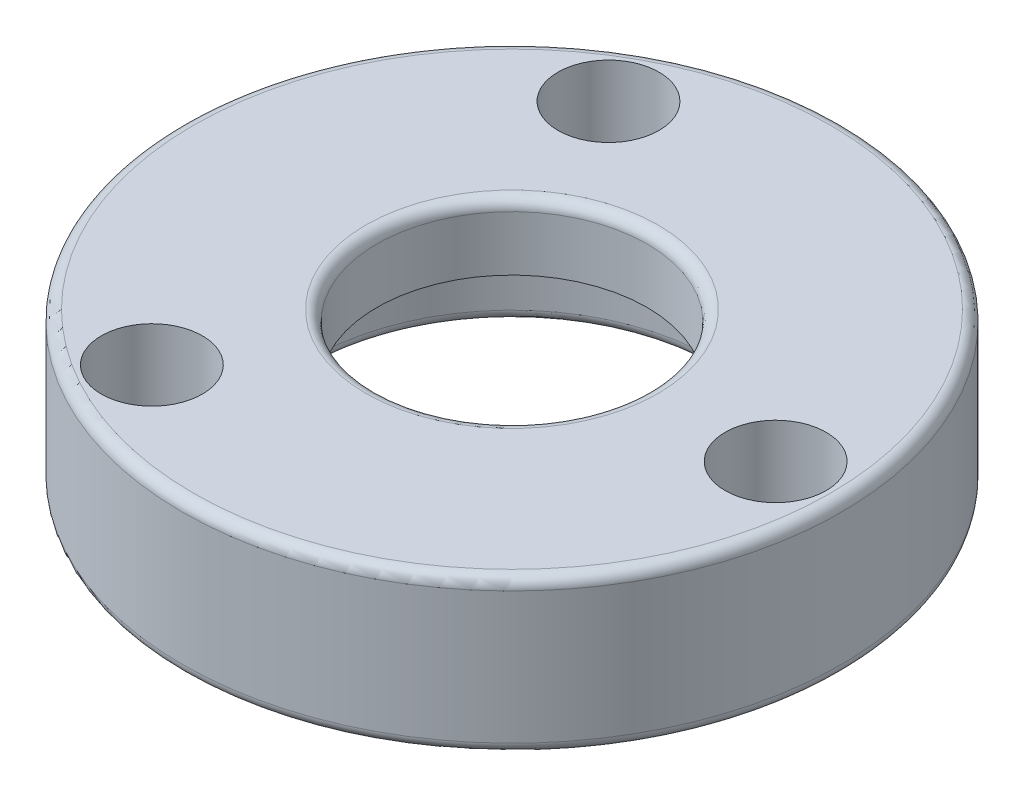
ISO-10303-21;
HEADER;
FILE_DESCRIPTION(('STEP AP214'),'2;1');
FILE_NAME('part.step','',(''),(''),'','','');
FILE_SCHEMA(('AUTOMOTIVE_DESIGN { 1 0 10303 214 1 1 1 1 }'));
ENDSEC;
DATA;
#1=APPLICATION_CONTEXT('core data for automotive mechanical design processes');
#2=APPLICATION_PROTOCOL_DEFINITION('international standard','automotive_design',2000,#1);
#3=PRODUCT_CONTEXT('',#1,'mechanical');
#4=PRODUCT('Part','Part','',(#3));
#5=PRODUCT_RELATED_PRODUCT_CATEGORY('part','',(#4));
#6=PRODUCT_DEFINITION_FORMATION('','',#4);
#7=PRODUCT_DEFINITION_CONTEXT('part definition',#1,'design');
#8=PRODUCT_DEFINITION('design','',#6,#7);
#9=PRODUCT_DEFINITION_SHAPE('','',#8);
#10=(LENGTH_UNIT() NAMED_UNIT(*) SI_UNIT(.MILLI.,.METRE.));
#11=(NAMED_UNIT(*) PLANE_ANGLE_UNIT() SI_UNIT($,.RADIAN.));
#12=(NAMED_UNIT(*) SI_UNIT($,.STERADIAN.) SOLID_ANGLE_UNIT());
#13=UNCERTAINTY_MEASURE_WITH_UNIT(LENGTH_MEASURE(1.E-05),#10,'distance_accuracy_value','');
#14=(GEOMETRIC_REPRESENTATION_CONTEXT(3) GLOBAL_UNCERTAINTY_ASSIGNED_CONTEXT((#13)) GLOBAL_UNIT_ASSIGNED_CONTEXT((#10,
#11,#12)) REPRESENTATION_CONTEXT('',''));
#15=CARTESIAN_POINT('',(0.,0.,0.));
#16=DIRECTION('',(0.,0.,1.));
#17=DIRECTION('',(1.,0.,0.));
#18=AXIS2_PLACEMENT_3D('',#15,#16,#17);
#19=CARTESIAN_POINT('',(-7.5,3.5,0.));
#20=DIRECTION('',(0.,-1.,0.));
#21=DIRECTION('',(0.,0.,-1.));
#22=AXIS2_PLACEMENT_3D('',#19,#20,#21);
#23=PLANE('',#22);
#24=CARTESIAN_POINT('',(0.,3.5,0.));
#25=DIRECTION('',(0.,-1.,0.));
#26=DIRECTION('',(0.,0.,-1.));
#27=AXIS2_PLACEMENT_3D('',#24,#25,#26);
#28=CIRCLE('',#27,7.25);
#29=CARTESIAN_POINT('',(0.,3.5,-7.25));
#30=VERTEX_POINT('',#29);
#31=EDGE_CURVE('E51',#30,#30,#28,.F.);
#32=ORIENTED_EDGE('',*,*,#31,.T.);
#33=EDGE_LOOP('',(#32));
#34=FACE_BOUND('',#33,.T.);
#35=CARTESIAN_POINT('',(0.,3.5,0.));
#36=DIRECTION('',(0.,-1.,0.));
#37=DIRECTION('',(0.,0.,-1.));
#38=AXIS2_PLACEMENT_3D('',#35,#36,#37);
#39=CIRCLE('',#38,3.3234);
#40=CARTESIAN_POINT('',(0.,3.5,-3.3234));
#41=VERTEX_POINT('',#40);
#42=EDGE_CURVE('E60',#41,#41,#39,.T.);
#43=ORIENTED_EDGE('',*,*,#42,.T.);
#44=EDGE_LOOP('',(#43));
#45=FACE_BOUND('',#44,.T.);
#46=CARTESIAN_POINT('',(-3.00000000000002,3.5,5.19615242270662));
#47=DIRECTION('',(0.,1.,0.));
#48=DIRECTION('',(0.,0.,1.));
#49=AXIS2_PLACEMENT_3D('',#46,#47,#48);
#50=CIRCLE('',#49,1.15);
#51=CARTESIAN_POINT('',(-3.00000000000002,3.5,6.34615242270662));
#52=VERTEX_POINT('',#51);
#53=EDGE_CURVE('E71',#52,#52,#50,.T.);
#54=ORIENTED_EDGE('',*,*,#53,.F.);
#55=EDGE_LOOP('',(#54));
#56=FACE_BOUND('',#55,.T.);
#57=CARTESIAN_POINT('',(-3.00000000000003,3.5,-5.19615242270662));
#58=DIRECTION('',(0.,1.,0.));
#59=DIRECTION('',(0.,0.,1.));
#60=AXIS2_PLACEMENT_3D('',#57,#58,#59);
#61=CIRCLE('',#60,1.15);
#62=CARTESIAN_POINT('',(-3.00000000000003,3.5,-4.04615242270662));
#63=VERTEX_POINT('',#62);
#64=EDGE_CURVE('E82',#63,#63,#61,.T.);
#65=ORIENTED_EDGE('',*,*,#64,.F.);
#66=EDGE_LOOP('',(#65));
#67=FACE_BOUND('',#66,.T.);
#68=CARTESIAN_POINT('',(6.,3.5,0.));
#69=DIRECTION('',(0.,1.,0.));
#70=DIRECTION('',(0.,0.,1.));
#71=AXIS2_PLACEMENT_3D('',#68,#69,#70);
#72=CIRCLE('',#71,1.15);
#73=CARTESIAN_POINT('',(6.,3.5,1.15));
#74=VERTEX_POINT('',#73);
#75=EDGE_CURVE('E67',#74,#74,#72,.T.);
#76=ORIENTED_EDGE('',*,*,#75,.F.);
#77=EDGE_LOOP('',(#76));
#78=FACE_BOUND('',#77,.T.);
#79=ADVANCED_FACE('F31',(#34,#45,#56,#67,#78),#23,.F.);
#80=CARTESIAN_POINT('',(0.,0.,0.));
#81=DIRECTION('',(0.,-1.,0.));
#82=DIRECTION('',(0.,0.,-1.));
#83=AXIS2_PLACEMENT_3D('',#80,#81,#82);
#84=CYLINDRICAL_SURFACE('',#83,3.0734);
#85=CARTESIAN_POINT('',(0.,3.25,0.));
#86=DIRECTION('',(0.,-1.,0.));
#87=DIRECTION('',(0.,0.,-1.));
#88=AXIS2_PLACEMENT_3D('',#85,#86,#87);
#89=CIRCLE('',#88,3.0734);
#90=CARTESIAN_POINT('',(0.,3.25,-3.0734));
#91=VERTEX_POINT('',#90);
#92=EDGE_CURVE('E57',#91,#91,#89,.F.);
#93=ORIENTED_EDGE('',*,*,#92,.T.);
#94=EDGE_LOOP('',(#93));
#95=FACE_BOUND('',#94,.T.);
#96=CARTESIAN_POINT('',(0.,2.,0.));
#97=DIRECTION('',(0.,-1.,0.));
#98=DIRECTION('',(0.,0.,-1.));
#99=AXIS2_PLACEMENT_3D('',#96,#97,#98);
#100=CIRCLE('',#99,3.0734);
#101=CARTESIAN_POINT('',(0.,2.,-3.0734));
#102=VERTEX_POINT('',#101);
#103=EDGE_CURVE('E63',#102,#102,#100,.T.);
#104=ORIENTED_EDGE('',*,*,#103,.T.);
#105=EDGE_LOOP('',(#104));
#106=FACE_BOUND('',#105,.T.);
#107=ADVANCED_FACE('F93',(#95,#106),#84,.F.);
#108=CARTESIAN_POINT('',(-3.0734,2.,0.));
#109=DIRECTION('',(0.,1.,0.));
#110=DIRECTION('',(0.,0.,1.));
#111=AXIS2_PLACEMENT_3D('',#108,#109,#110);
#112=PLANE('',#111);
#113=ORIENTED_EDGE('',*,*,#103,.F.);
#114=EDGE_LOOP('',(#113));
#115=FACE_BOUND('',#114,.T.);
#116=CARTESIAN_POINT('',(0.,2.,0.));
#117=DIRECTION('',(0.,-1.,0.));
#118=DIRECTION('',(0.,0.,-1.));
#119=AXIS2_PLACEMENT_3D('',#116,#117,#118);
#120=CIRCLE('',#119,4.572);
#121=CARTESIAN_POINT('',(0.,2.,-4.572));
#122=VERTEX_POINT('',#121);
#123=EDGE_CURVE('E75',#122,#122,#120,.T.);
#124=ORIENTED_EDGE('',*,*,#123,.T.);
#125=EDGE_LOOP('',(#124));
#126=FACE_BOUND('',#125,.T.);
#127=ADVANCED_FACE('F117',(#115,#126),#112,.F.);
#128=CARTESIAN_POINT('',(0.,0.,0.));
#129=DIRECTION('',(0.,-1.,0.));
#130=DIRECTION('',(0.,0.,-1.));
#131=AXIS2_PLACEMENT_3D('',#128,#129,#130);
#132=CYLINDRICAL_SURFACE('',#131,4.572);
#133=CARTESIAN_POINT('',(0.,0.25,0.));
#134=DIRECTION('',(0.,1.,0.));
#135=DIRECTION('',(0.,0.,1.));
#136=AXIS2_PLACEMENT_3D('',#133,#134,#135);
#137=CIRCLE('',#136,4.572);
#138=CARTESIAN_POINT('',(0.,0.25,4.572));
#139=VERTEX_POINT('',#138);
#140=EDGE_CURVE('E46',#139,#139,#137,.F.);
#141=ORIENTED_EDGE('',*,*,#140,.T.);
#142=EDGE_LOOP('',(#141));
#143=FACE_BOUND('',#142,.T.);
#144=ORIENTED_EDGE('',*,*,#123,.F.);
#145=EDGE_LOOP('',(#144));
#146=FACE_BOUND('',#145,.T.);
#147=ADVANCED_FACE('F110',(#143,#146),#132,.F.);
#148=CARTESIAN_POINT('',(-4.572,0.,0.));
#149=DIRECTION('',(0.,1.,0.));
#150=DIRECTION('',(0.,0.,1.));
#151=AXIS2_PLACEMENT_3D('',#148,#149,#150);
#152=PLANE('',#151);
#153=CARTESIAN_POINT('',(0.,0.,0.));
#154=DIRECTION('',(0.,1.,0.));
#155=DIRECTION('',(0.,0.,1.));
#156=AXIS2_PLACEMENT_3D('',#153,#154,#155);
#157=CIRCLE('',#156,4.822);
#158=CARTESIAN_POINT('',(0.,0.,4.822));
#159=VERTEX_POINT('',#158);
#160=EDGE_CURVE('E38',#159,#159,#157,.T.);
#161=ORIENTED_EDGE('',*,*,#160,.T.);
#162=EDGE_LOOP('',(#161));
#163=FACE_BOUND('',#162,.T.);
#164=CARTESIAN_POINT('',(0.,0.,0.));
#165=DIRECTION('',(0.,1.,0.));
#166=DIRECTION('',(0.,0.,1.));
#167=AXIS2_PLACEMENT_3D('',#164,#165,#166);
#168=CIRCLE('',#167,7.25);
#169=CARTESIAN_POINT('',(0.,0.,7.25));
#170=VERTEX_POINT('',#169);
#171=EDGE_CURVE('E42',#170,#170,#168,.F.);
#172=ORIENTED_EDGE('',*,*,#171,.T.);
#173=EDGE_LOOP('',(#172));
#174=FACE_BOUND('',#173,.T.);
#175=CARTESIAN_POINT('',(-3.00000000000002,0.,5.19615242270662));
#176=DIRECTION('',(0.,1.,0.));
#177=DIRECTION('',(0.,0.,1.));
#178=AXIS2_PLACEMENT_3D('',#175,#176,#177);
#179=CIRCLE('',#178,1.15);
#180=CARTESIAN_POINT('',(-3.00000000000002,0.,6.34615242270662));
#181=VERTEX_POINT('',#180);
#182=EDGE_CURVE('E64',#181,#181,#179,.T.);
#183=ORIENTED_EDGE('',*,*,#182,.T.);
#184=EDGE_LOOP('',(#183));
#185=FACE_BOUND('',#184,.T.);
#186=CARTESIAN_POINT('',(-3.00000000000003,0.,-5.19615242270662));
#187=DIRECTION('',(0.,1.,0.));
#188=DIRECTION('',(0.,0.,1.));
#189=AXIS2_PLACEMENT_3D('',#186,#187,#188);
#190=CIRCLE('',#189,1.15);
#191=CARTESIAN_POINT('',(-3.00000000000003,0.,-4.04615242270662));
#192=VERTEX_POINT('',#191);
#193=EDGE_CURVE('E68',#192,#192,#190,.T.);
#194=ORIENTED_EDGE('',*,*,#193,.T.);
#195=EDGE_LOOP('',(#194));
#196=FACE_BOUND('',#195,.T.);
#197=CARTESIAN_POINT('',(6.,0.,0.));
#198=DIRECTION('',(0.,1.,0.));
#199=DIRECTION('',(0.,0.,1.));
#200=AXIS2_PLACEMENT_3D('',#197,#198,#199);
#201=CIRCLE('',#200,1.15);
#202=CARTESIAN_POINT('',(6.,0.,1.15));
#203=VERTEX_POINT('',#202);
#204=EDGE_CURVE('E72',#203,#203,#201,.T.);
#205=ORIENTED_EDGE('',*,*,#204,.T.);
#206=EDGE_LOOP('',(#205));
#207=FACE_BOUND('',#206,.T.);
#208=ADVANCED_FACE('F108',(#163,#174,#185,#196,#207),#152,.F.);
#209=CARTESIAN_POINT('',(0.,0.,0.));
#210=DIRECTION('',(0.,-1.,0.));
#211=DIRECTION('',(0.,0.,-1.));
#212=AXIS2_PLACEMENT_3D('',#209,#210,#211);
#213=CYLINDRICAL_SURFACE('',#212,7.5);
#214=CARTESIAN_POINT('',(0.,0.25,0.));
#215=DIRECTION('',(0.,1.,0.));
#216=DIRECTION('',(0.,0.,1.));
#217=AXIS2_PLACEMENT_3D('',#214,#215,#216);
#218=CIRCLE('',#217,7.5);
#219=CARTESIAN_POINT('',(0.,0.25,7.5));
#220=VERTEX_POINT('',#219);
#221=EDGE_CURVE('E10',#220,#220,#218,.T.);
#222=ORIENTED_EDGE('',*,*,#221,.T.);
#223=EDGE_LOOP('',(#222));
#224=FACE_BOUND('',#223,.T.);
#225=CARTESIAN_POINT('',(0.,3.25,0.));
#226=DIRECTION('',(0.,-1.,0.));
#227=DIRECTION('',(0.,0.,-1.));
#228=AXIS2_PLACEMENT_3D('',#225,#226,#227);
#229=CIRCLE('',#228,7.5);
#230=CARTESIAN_POINT('',(0.,3.25,-7.5));
#231=VERTEX_POINT('',#230);
#232=EDGE_CURVE('E54',#231,#231,#229,.T.);
#233=ORIENTED_EDGE('',*,*,#232,.T.);
#234=EDGE_LOOP('',(#233));
#235=FACE_BOUND('',#234,.T.);
#236=ADVANCED_FACE('F104',(#224,#235),#213,.T.);
#237=CARTESIAN_POINT('',(6.,-6.5,0.));
#238=DIRECTION('',(0.,1.,0.));
#239=DIRECTION('',(0.,0.,1.));
#240=AXIS2_PLACEMENT_3D('',#237,#238,#239);
#241=CYLINDRICAL_SURFACE('',#240,1.15);
#242=ORIENTED_EDGE('',*,*,#75,.T.);
#243=EDGE_LOOP('',(#242));
#244=FACE_BOUND('',#243,.T.);
#245=ORIENTED_EDGE('',*,*,#204,.F.);
#246=EDGE_LOOP('',(#245));
#247=FACE_BOUND('',#246,.T.);
#248=ADVANCED_FACE('F100',(#244,#247),#241,.F.);
#249=CARTESIAN_POINT('',(-3.00000000000003,-6.5,-5.19615242270662));
#250=DIRECTION('',(0.,1.,0.));
#251=DIRECTION('',(0.,0.,1.));
#252=AXIS2_PLACEMENT_3D('',#249,#250,#251);
#253=CYLINDRICAL_SURFACE('',#252,1.15);
#254=ORIENTED_EDGE('',*,*,#64,.T.);
#255=EDGE_LOOP('',(#254));
#256=FACE_BOUND('',#255,.T.);
#257=ORIENTED_EDGE('',*,*,#193,.F.);
#258=EDGE_LOOP('',(#257));
#259=FACE_BOUND('',#258,.T.);
#260=ADVANCED_FACE('F103',(#256,#259),#253,.F.);
#261=CARTESIAN_POINT('',(-3.00000000000002,-6.5,5.19615242270662));
#262=DIRECTION('',(0.,1.,0.));
#263=DIRECTION('',(0.,0.,1.));
#264=AXIS2_PLACEMENT_3D('',#261,#262,#263);
#265=CYLINDRICAL_SURFACE('',#264,1.15);
#266=ORIENTED_EDGE('',*,*,#53,.T.);
#267=EDGE_LOOP('',(#266));
#268=FACE_BOUND('',#267,.T.);
#269=ORIENTED_EDGE('',*,*,#182,.F.);
#270=EDGE_LOOP('',(#269));
#271=FACE_BOUND('',#270,.T.);
#272=ADVANCED_FACE('F88',(#268,#271),#265,.F.);
#273=CARTESIAN_POINT('',(0.,3.25,0.));
#274=DIRECTION('',(0.,-1.,0.));
#275=DIRECTION('',(0.,0.,-1.));
#276=AXIS2_PLACEMENT_3D('',#273,#274,#275);
#277=TOROIDAL_SURFACE('',#276,3.3234,0.25);
#278=ORIENTED_EDGE('',*,*,#92,.F.);
#279=EDGE_LOOP('',(#278));
#280=FACE_BOUND('',#279,.T.);
#281=ORIENTED_EDGE('',*,*,#42,.F.);
#282=EDGE_LOOP('',(#281));
#283=FACE_BOUND('',#282,.T.);
#284=ADVANCED_FACE('F128',(#280,#283),#277,.T.);
#285=CARTESIAN_POINT('',(0.,3.25,0.));
#286=DIRECTION('',(0.,-1.,0.));
#287=DIRECTION('',(0.,0.,-1.));
#288=AXIS2_PLACEMENT_3D('',#285,#286,#287);
#289=TOROIDAL_SURFACE('',#288,7.25,0.25);
#290=ORIENTED_EDGE('',*,*,#31,.F.);
#291=EDGE_LOOP('',(#290));
#292=FACE_BOUND('',#291,.T.);
#293=ORIENTED_EDGE('',*,*,#232,.F.);
#294=EDGE_LOOP('',(#293));
#295=FACE_BOUND('',#294,.T.);
#296=ADVANCED_FACE('F131',(#292,#295),#289,.T.);
#297=CARTESIAN_POINT('',(0.,0.25,0.));
#298=DIRECTION('',(0.,1.,0.));
#299=DIRECTION('',(0.,0.,1.));
#300=AXIS2_PLACEMENT_3D('',#297,#298,#299);
#301=TOROIDAL_SURFACE('',#300,4.822,0.25);
#302=ORIENTED_EDGE('',*,*,#160,.F.);
#303=EDGE_LOOP('',(#302));
#304=FACE_BOUND('',#303,.T.);
#305=ORIENTED_EDGE('',*,*,#140,.F.);
#306=EDGE_LOOP('',(#305));
#307=FACE_BOUND('',#306,.T.);
#308=ADVANCED_FACE('F134',(#304,#307),#301,.T.);
#309=CARTESIAN_POINT('',(0.,0.25,0.));
#310=DIRECTION('',(0.,1.,0.));
#311=DIRECTION('',(0.,0.,1.));
#312=AXIS2_PLACEMENT_3D('',#309,#310,#311);
#313=TOROIDAL_SURFACE('',#312,7.25,0.25);
#314=ORIENTED_EDGE('',*,*,#221,.F.);
#315=EDGE_LOOP('',(#314));
#316=FACE_BOUND('',#315,.T.);
#317=ORIENTED_EDGE('',*,*,#171,.F.);
#318=EDGE_LOOP('',(#317));
#319=FACE_BOUND('',#318,.T.);
#320=ADVANCED_FACE('F33',(#316,#319),#313,.T.);
#321=CLOSED_SHELL('',(#79,#107,#127,#147,#208,#236,#248,#260,#272,#284,#296,#308,#320));
#322=MANIFOLD_SOLID_BREP('B2',#321);
#323=ADVANCED_BREP_SHAPE_REPRESENTATION('',(#18,#322),#14);
#324=SHAPE_DEFINITION_REPRESENTATION(#9,#323);
ENDSEC;
END-ISO-10303-21;
